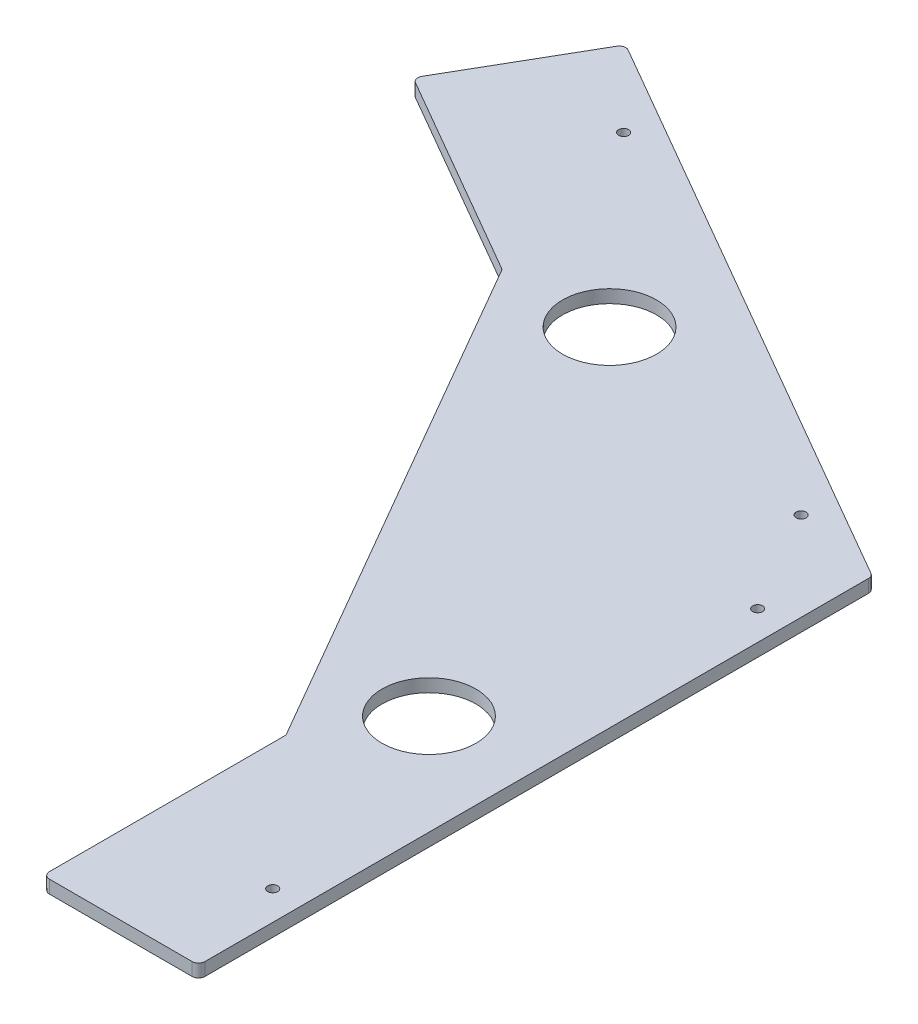
ISO-10303-21;
HEADER;
FILE_DESCRIPTION(('STEP AP214'),'2;1');
FILE_NAME('part.step','',(''),(''),'','','');
FILE_SCHEMA(('AUTOMOTIVE_DESIGN { 1 0 10303 214 1 1 1 1 }'));
ENDSEC;
DATA;
#1=APPLICATION_CONTEXT('core data for automotive mechanical design processes');
#2=APPLICATION_PROTOCOL_DEFINITION('international standard','automotive_design',2000,#1);
#3=PRODUCT_CONTEXT('',#1,'mechanical');
#4=PRODUCT('Part','Part','',(#3));
#5=PRODUCT_RELATED_PRODUCT_CATEGORY('part','',(#4));
#6=PRODUCT_DEFINITION_FORMATION('','',#4);
#7=PRODUCT_DEFINITION_CONTEXT('part definition',#1,'design');
#8=PRODUCT_DEFINITION('design','',#6,#7);
#9=PRODUCT_DEFINITION_SHAPE('','',#8);
#10=(LENGTH_UNIT() NAMED_UNIT(*) SI_UNIT(.MILLI.,.METRE.));
#11=(NAMED_UNIT(*) PLANE_ANGLE_UNIT() SI_UNIT($,.RADIAN.));
#12=(NAMED_UNIT(*) SI_UNIT($,.STERADIAN.) SOLID_ANGLE_UNIT());
#13=UNCERTAINTY_MEASURE_WITH_UNIT(LENGTH_MEASURE(1.E-05),#10,'distance_accuracy_value','');
#14=(GEOMETRIC_REPRESENTATION_CONTEXT(3) GLOBAL_UNCERTAINTY_ASSIGNED_CONTEXT((#13)) GLOBAL_UNIT_ASSIGNED_CONTEXT((#10,
#11,#12)) REPRESENTATION_CONTEXT('',''));
#15=CARTESIAN_POINT('',(0.,0.,0.));
#16=DIRECTION('',(0.,0.,1.));
#17=DIRECTION('',(1.,0.,0.));
#18=AXIS2_PLACEMENT_3D('',#15,#16,#17);
#19=CARTESIAN_POINT('',(0.,6.35,0.));
#20=DIRECTION('',(0.,1.,0.));
#21=DIRECTION('',(0.,0.,1.));
#22=AXIS2_PLACEMENT_3D('',#19,#20,#21);
#23=PLANE('',#22);
#24=CARTESIAN_POINT('',(-43.4068750823877,6.35,-338.518865913276));
#25=DIRECTION('',(0.,1.,0.));
#26=DIRECTION('',(0.,0.,1.));
#27=AXIS2_PLACEMENT_3D('',#24,#25,#26);
#28=CIRCLE('',#27,2.45744999999987);
#29=CARTESIAN_POINT('',(-43.4068750823877,6.35,-336.061415913276));
#30=VERTEX_POINT('',#29);
#31=EDGE_CURVE('E291',#30,#30,#28,.T.);
#32=ORIENTED_EDGE('',*,*,#31,.F.);
#33=EDGE_LOOP('',(#32));
#34=FACE_BOUND('',#33,.T.);
#35=CARTESIAN_POINT('',(-49.2124999999999,6.35,-162.061031219973));
#36=DIRECTION('',(0.,1.,0.));
#37=DIRECTION('',(0.,0.,1.));
#38=AXIS2_PLACEMENT_3D('',#35,#36,#37);
#39=CIRCLE('',#38,23.0187499999997);
#40=CARTESIAN_POINT('',(-49.2124999999999,6.35,-139.042281219974));
#41=VERTEX_POINT('',#40);
#42=EDGE_CURVE('E279',#41,#41,#39,.T.);
#43=ORIENTED_EDGE('',*,*,#42,.F.);
#44=EDGE_LOOP('',(#43));
#45=FACE_BOUND('',#44,.T.);
#46=CARTESIAN_POINT('',(-14.2874999999997,6.35,-50.6078687859258));
#47=DIRECTION('',(0.,1.,0.));
#48=DIRECTION('',(0.,0.,1.));
#49=AXIS2_PLACEMENT_3D('',#46,#47,#48);
#50=CIRCLE('',#49,2.45744999999931);
#51=CARTESIAN_POINT('',(-14.2874999999997,6.35,-48.1504187859265));
#52=VERTEX_POINT('',#51);
#53=EDGE_CURVE('E250',#52,#52,#50,.T.);
#54=ORIENTED_EDGE('',*,*,#53,.F.);
#55=EDGE_LOOP('',(#54));
#56=FACE_BOUND('',#55,.T.);
#57=DIRECTION('',(-0.499999999999996,0.,0.866025403784441));
#58=VECTOR('',#57,1.);
#59=CARTESIAN_POINT('',(-285.750000000001,6.35,-494.933518262806));
#60=LINE('',#59,#58);
#61=CARTESIAN_POINT('',(-287.337500000001,6.35,-492.183887605791));
#62=VERTEX_POINT('',#61);
#63=CARTESIAN_POINT('',(-322.2625,6.35,-431.692013151448));
#64=VERTEX_POINT('',#63);
#65=EDGE_CURVE('E242',#62,#64,#60,.T.);
#66=ORIENTED_EDGE('',*,*,#65,.T.);
#67=CARTESIAN_POINT('',(-319.512869342985,6.35,-430.104513151448));
#68=DIRECTION('',(0.,1.,0.));
#69=DIRECTION('',(0.,0.,1.));
#70=AXIS2_PLACEMENT_3D('',#67,#68,#69);
#71=CIRCLE('',#70,3.175);
#72=CARTESIAN_POINT('',(-321.100369342985,6.35,-427.354882494432));
#73=VERTEX_POINT('',#72);
#74=EDGE_CURVE('E205',#64,#73,#71,.T.);
#75=ORIENTED_EDGE('',*,*,#74,.T.);
#76=DIRECTION('',(0.86602540378444,0.,0.499999999999998));
#77=VECTOR('',#76,1.);
#78=CARTESIAN_POINT('',(-323.85,6.35,-428.942382494432));
#79=LINE('',#78,#77);
#80=CARTESIAN_POINT('',(-221.496872271715,6.35,-369.848776648106));
#81=VERTEX_POINT('',#80);
#82=EDGE_CURVE('E237',#73,#81,#79,.T.);
#83=ORIENTED_EDGE('',*,*,#82,.T.);
#84=CARTESIAN_POINT('',(-223.084372271715,6.35,-367.099145991091));
#85=DIRECTION('',(0.,1.,0.));
#86=DIRECTION('',(0.,0.,1.));
#87=AXIS2_PLACEMENT_3D('',#84,#85,#86);
#88=CIRCLE('',#87,3.175);
#89=CARTESIAN_POINT('',(-220.334741614699,6.35,-368.686645991091));
#90=VERTEX_POINT('',#89);
#91=EDGE_CURVE('E11',#81,#90,#88,.F.);
#92=ORIENTED_EDGE('',*,*,#91,.T.);
#93=DIRECTION('',(0.500000000000001,0.,0.866025403784438));
#94=VECTOR('',#93,1.);
#95=CARTESIAN_POINT('',(-220.760110957684,6.35,-369.423407305122));
#96=LINE('',#95,#94);
#97=CARTESIAN_POINT('',(-76.6253693429844,6.35,-119.774711692651));
#98=VERTEX_POINT('',#97);
#99=EDGE_CURVE('E236',#90,#98,#96,.T.);
#100=ORIENTED_EDGE('',*,*,#99,.T.);
#101=CARTESIAN_POINT('',(-79.375,6.35,-118.187211692651));
#102=DIRECTION('',(0.,1.,0.));
#103=DIRECTION('',(0.,0.,1.));
#104=AXIS2_PLACEMENT_3D('',#101,#102,#103);
#105=CIRCLE('',#104,3.175);
#106=CARTESIAN_POINT('',(-76.2,6.35,-118.187211692651));
#107=VERTEX_POINT('',#106);
#108=EDGE_CURVE('E146',#98,#107,#105,.F.);
#109=ORIENTED_EDGE('',*,*,#108,.T.);
#110=DIRECTION('',(0.,0.,1.));
#111=VECTOR('',#110,1.);
#112=CARTESIAN_POINT('',(-76.2,6.35,-119.03795037862));
#113=LINE('',#112,#111);
#114=CARTESIAN_POINT('',(-76.2,6.35,-3.175));
#115=VERTEX_POINT('',#114);
#116=EDGE_CURVE('E156',#107,#115,#113,.T.);
#117=ORIENTED_EDGE('',*,*,#116,.T.);
#118=CARTESIAN_POINT('',(-73.025,6.35,-3.175));
#119=DIRECTION('',(0.,1.,0.));
#120=DIRECTION('',(0.,0.,1.));
#121=AXIS2_PLACEMENT_3D('',#118,#119,#120);
#122=CIRCLE('',#121,3.175);
#123=CARTESIAN_POINT('',(-73.025,6.35,0.));
#124=VERTEX_POINT('',#123);
#125=EDGE_CURVE('E198',#115,#124,#122,.T.);
#126=ORIENTED_EDGE('',*,*,#125,.T.);
#127=DIRECTION('',(1.,0.,0.));
#128=VECTOR('',#127,1.);
#129=CARTESIAN_POINT('',(-76.2,6.35,0.));
#130=LINE('',#129,#128);
#131=CARTESIAN_POINT('',(-3.17500000000003,6.35,0.));
#132=VERTEX_POINT('',#131);
#133=EDGE_CURVE('E165',#124,#132,#130,.T.);
#134=ORIENTED_EDGE('',*,*,#133,.T.);
#135=CARTESIAN_POINT('',(-3.175,6.35,-3.175));
#136=DIRECTION('',(0.,1.,0.));
#137=DIRECTION('',(0.,0.,1.));
#138=AXIS2_PLACEMENT_3D('',#135,#136,#137);
#139=CIRCLE('',#138,3.175);
#140=CARTESIAN_POINT('',(0.,6.35,-3.175));
#141=VERTEX_POINT('',#140);
#142=EDGE_CURVE('E200',#132,#141,#139,.T.);
#143=ORIENTED_EDGE('',*,*,#142,.T.);
#144=DIRECTION('',(0.,0.,-1.));
#145=VECTOR('',#144,1.);
#146=CARTESIAN_POINT('',(0.,6.35,0.));
#147=LINE('',#146,#145);
#148=CARTESIAN_POINT('',(0.,6.35,-328.122591737194));
#149=VERTEX_POINT('',#148);
#150=EDGE_CURVE('E169',#141,#149,#147,.T.);
#151=ORIENTED_EDGE('',*,*,#150,.T.);
#152=CARTESIAN_POINT('',(-3.175,6.35,-328.122591737194));
#153=DIRECTION('',(0.,1.,0.));
#154=DIRECTION('',(0.,0.,1.));
#155=AXIS2_PLACEMENT_3D('',#152,#153,#154);
#156=CIRCLE('',#155,3.175);
#157=CARTESIAN_POINT('',(-1.58750000000003,6.35,-330.87222239421));
#158=VERTEX_POINT('',#157);
#159=EDGE_CURVE('E56',#149,#158,#156,.T.);
#160=ORIENTED_EDGE('',*,*,#159,.T.);
#161=DIRECTION('',(-0.86602540378444,0.,-0.499999999999998));
#162=VECTOR('',#161,1.);
#163=CARTESIAN_POINT('',(0.,6.35,-329.955678841871));
#164=LINE('',#163,#162);
#165=CARTESIAN_POINT('',(-283.000369342985,6.35,-493.346018262806));
#166=VERTEX_POINT('',#165);
#167=EDGE_CURVE('E266',#158,#166,#164,.T.);
#168=ORIENTED_EDGE('',*,*,#167,.T.);
#169=CARTESIAN_POINT('',(-284.587869342985,6.35,-490.596387605791));
#170=DIRECTION('',(0.,1.,0.));
#171=DIRECTION('',(0.,0.,1.));
#172=AXIS2_PLACEMENT_3D('',#169,#170,#171);
#173=CIRCLE('',#172,3.175);
#174=EDGE_CURVE('E203',#166,#62,#173,.T.);
#175=ORIENTED_EDGE('',*,*,#174,.T.);
#176=EDGE_LOOP('',(#66,#75,#83,#92,#100,#109,#117,#126,#134,#143,#151,#160,#168,#175));
#177=FACE_BOUND('',#176,.T.);
#178=CARTESIAN_POINT('',(-14.2875,6.35,-288.082628785925));
#179=DIRECTION('',(0.,1.,0.));
#180=DIRECTION('',(0.,0.,1.));
#181=AXIS2_PLACEMENT_3D('',#178,#179,#180);
#182=CIRCLE('',#181,2.45744999999968);
#183=CARTESIAN_POINT('',(-14.2875,6.35,-285.625178785926));
#184=VERTEX_POINT('',#183);
#185=EDGE_CURVE('E273',#184,#184,#182,.T.);
#186=ORIENTED_EDGE('',*,*,#185,.F.);
#187=EDGE_LOOP('',(#186));
#188=FACE_BOUND('',#187,.T.);
#189=CARTESIAN_POINT('',(-170.00728,6.35,-371.283727469078));
#190=DIRECTION('',(0.,1.,0.));
#191=DIRECTION('',(0.,0.,1.));
#192=AXIS2_PLACEMENT_3D('',#189,#190,#191);
#193=CIRCLE('',#192,23.01875);
#194=CARTESIAN_POINT('',(-170.00728,6.35,-348.264977469078));
#195=VERTEX_POINT('',#194);
#196=EDGE_CURVE('E285',#195,#195,#193,.T.);
#197=ORIENTED_EDGE('',*,*,#196,.F.);
#198=EDGE_LOOP('',(#197));
#199=FACE_BOUND('',#198,.T.);
#200=CARTESIAN_POINT('',(-249.066050000001,6.35,-457.256245913275));
#201=DIRECTION('',(0.,1.,0.));
#202=DIRECTION('',(0.,0.,1.));
#203=AXIS2_PLACEMENT_3D('',#200,#201,#202);
#204=CIRCLE('',#203,2.45745000000076);
#205=CARTESIAN_POINT('',(-249.066050000001,6.35,-454.798795913274));
#206=VERTEX_POINT('',#205);
#207=EDGE_CURVE('E297',#206,#206,#204,.T.);
#208=ORIENTED_EDGE('',*,*,#207,.F.);
#209=EDGE_LOOP('',(#208));
#210=FACE_BOUND('',#209,.T.);
#211=ADVANCED_FACE('F34',(#34,#45,#56,#177,#188,#199,#210),#23,.T.);
#212=CARTESIAN_POINT('',(0.,0.,0.));
#213=DIRECTION('',(0.,1.,0.));
#214=DIRECTION('',(0.,0.,1.));
#215=AXIS2_PLACEMENT_3D('',#212,#213,#214);
#216=PLANE('',#215);
#217=DIRECTION('',(0.86602540378444,0.,0.499999999999998));
#218=VECTOR('',#217,1.);
#219=CARTESIAN_POINT('',(-323.85,0.,-428.942382494432));
#220=LINE('',#219,#218);
#221=CARTESIAN_POINT('',(-321.100369342985,0.,-427.354882494432));
#222=VERTEX_POINT('',#221);
#223=CARTESIAN_POINT('',(-221.496872271715,0.,-369.848776648106));
#224=VERTEX_POINT('',#223);
#225=EDGE_CURVE('E171',#222,#224,#220,.T.);
#226=ORIENTED_EDGE('',*,*,#225,.F.);
#227=CARTESIAN_POINT('',(-319.512869342985,0.,-430.104513151448));
#228=DIRECTION('',(0.,1.,0.));
#229=DIRECTION('',(0.,0.,1.));
#230=AXIS2_PLACEMENT_3D('',#227,#228,#229);
#231=CIRCLE('',#230,3.175);
#232=CARTESIAN_POINT('',(-322.2625,0.,-431.692013151448));
#233=VERTEX_POINT('',#232);
#234=EDGE_CURVE('E191',#222,#233,#231,.F.);
#235=ORIENTED_EDGE('',*,*,#234,.T.);
#236=DIRECTION('',(-0.499999999999996,0.,0.866025403784441));
#237=VECTOR('',#236,1.);
#238=CARTESIAN_POINT('',(-285.750000000001,0.,-494.933518262806));
#239=LINE('',#238,#237);
#240=CARTESIAN_POINT('',(-287.337500000001,0.,-492.183887605791));
#241=VERTEX_POINT('',#240);
#242=EDGE_CURVE('E229',#241,#233,#239,.T.);
#243=ORIENTED_EDGE('',*,*,#242,.F.);
#244=CARTESIAN_POINT('',(-284.587869342985,0.,-490.596387605791));
#245=DIRECTION('',(0.,1.,0.));
#246=DIRECTION('',(0.,0.,1.));
#247=AXIS2_PLACEMENT_3D('',#244,#245,#246);
#248=CIRCLE('',#247,3.175);
#249=CARTESIAN_POINT('',(-283.000369342985,0.,-493.346018262806));
#250=VERTEX_POINT('',#249);
#251=EDGE_CURVE('E189',#241,#250,#248,.F.);
#252=ORIENTED_EDGE('',*,*,#251,.T.);
#253=DIRECTION('',(-0.86602540378444,0.,-0.499999999999998));
#254=VECTOR('',#253,1.);
#255=CARTESIAN_POINT('',(0.,0.,-329.955678841871));
#256=LINE('',#255,#254);
#257=CARTESIAN_POINT('',(-1.58750000000003,0.,-330.87222239421));
#258=VERTEX_POINT('',#257);
#259=EDGE_CURVE('E253',#258,#250,#256,.T.);
#260=ORIENTED_EDGE('',*,*,#259,.F.);
#261=CARTESIAN_POINT('',(-3.175,0.,-328.122591737194));
#262=DIRECTION('',(0.,1.,0.));
#263=DIRECTION('',(0.,0.,1.));
#264=AXIS2_PLACEMENT_3D('',#261,#262,#263);
#265=CIRCLE('',#264,3.175);
#266=CARTESIAN_POINT('',(0.,0.,-328.122591737194));
#267=VERTEX_POINT('',#266);
#268=EDGE_CURVE('E187',#258,#267,#265,.F.);
#269=ORIENTED_EDGE('',*,*,#268,.T.);
#270=DIRECTION('',(0.,0.,-1.));
#271=VECTOR('',#270,1.);
#272=CARTESIAN_POINT('',(0.,0.,0.));
#273=LINE('',#272,#271);
#274=CARTESIAN_POINT('',(0.,0.,-3.175));
#275=VERTEX_POINT('',#274);
#276=EDGE_CURVE('E249',#275,#267,#273,.T.);
#277=ORIENTED_EDGE('',*,*,#276,.F.);
#278=CARTESIAN_POINT('',(-3.175,0.,-3.175));
#279=DIRECTION('',(0.,1.,0.));
#280=DIRECTION('',(0.,0.,1.));
#281=AXIS2_PLACEMENT_3D('',#278,#279,#280);
#282=CIRCLE('',#281,3.175);
#283=CARTESIAN_POINT('',(-3.17500000000003,0.,0.));
#284=VERTEX_POINT('',#283);
#285=EDGE_CURVE('E185',#275,#284,#282,.F.);
#286=ORIENTED_EDGE('',*,*,#285,.T.);
#287=DIRECTION('',(1.,0.,0.));
#288=VECTOR('',#287,1.);
#289=CARTESIAN_POINT('',(-76.2,0.,0.));
#290=LINE('',#289,#288);
#291=CARTESIAN_POINT('',(-73.025,0.,0.));
#292=VERTEX_POINT('',#291);
#293=EDGE_CURVE('E246',#292,#284,#290,.T.);
#294=ORIENTED_EDGE('',*,*,#293,.F.);
#295=CARTESIAN_POINT('',(-73.025,0.,-3.175));
#296=DIRECTION('',(0.,1.,0.));
#297=DIRECTION('',(0.,0.,1.));
#298=AXIS2_PLACEMENT_3D('',#295,#296,#297);
#299=CIRCLE('',#298,3.175);
#300=CARTESIAN_POINT('',(-76.2,0.,-3.175));
#301=VERTEX_POINT('',#300);
#302=EDGE_CURVE('E164',#292,#301,#299,.F.);
#303=ORIENTED_EDGE('',*,*,#302,.T.);
#304=DIRECTION('',(0.,0.,1.));
#305=VECTOR('',#304,1.);
#306=CARTESIAN_POINT('',(-76.2,0.,-119.03795037862));
#307=LINE('',#306,#305);
#308=CARTESIAN_POINT('',(-76.2,0.,-118.187211692651));
#309=VERTEX_POINT('',#308);
#310=EDGE_CURVE('E153',#309,#301,#307,.T.);
#311=ORIENTED_EDGE('',*,*,#310,.F.);
#312=CARTESIAN_POINT('',(-79.375,0.,-118.187211692651));
#313=DIRECTION('',(0.,1.,0.));
#314=DIRECTION('',(0.,0.,1.));
#315=AXIS2_PLACEMENT_3D('',#312,#313,#314);
#316=CIRCLE('',#315,3.175);
#317=CARTESIAN_POINT('',(-76.6253693429844,0.,-119.774711692651));
#318=VERTEX_POINT('',#317);
#319=EDGE_CURVE('E136',#309,#318,#316,.T.);
#320=ORIENTED_EDGE('',*,*,#319,.T.);
#321=DIRECTION('',(0.500000000000001,0.,0.866025403784438));
#322=VECTOR('',#321,1.);
#323=CARTESIAN_POINT('',(-220.760110957684,0.,-369.423407305122));
#324=LINE('',#323,#322);
#325=CARTESIAN_POINT('',(-220.334741614699,0.,-368.686645991091));
#326=VERTEX_POINT('',#325);
#327=EDGE_CURVE('E166',#326,#318,#324,.T.);
#328=ORIENTED_EDGE('',*,*,#327,.F.);
#329=CARTESIAN_POINT('',(-223.084372271715,0.,-367.099145991091));
#330=DIRECTION('',(0.,1.,0.));
#331=DIRECTION('',(0.,0.,1.));
#332=AXIS2_PLACEMENT_3D('',#329,#330,#331);
#333=CIRCLE('',#332,3.175);
#334=EDGE_CURVE('E42',#326,#224,#333,.T.);
#335=ORIENTED_EDGE('',*,*,#334,.T.);
#336=EDGE_LOOP('',(#226,#235,#243,#252,#260,#269,#277,#286,#294,#303,#311,#320,#328,#335));
#337=FACE_BOUND('',#336,.T.);
#338=CARTESIAN_POINT('',(-14.2874999999997,0.,-50.6078687859258));
#339=DIRECTION('',(0.,1.,0.));
#340=DIRECTION('',(0.,0.,1.));
#341=AXIS2_PLACEMENT_3D('',#338,#339,#340);
#342=CIRCLE('',#341,2.45744999999931);
#343=CARTESIAN_POINT('',(-14.2874999999997,0.,-48.1504187859265));
#344=VERTEX_POINT('',#343);
#345=EDGE_CURVE('E270',#344,#344,#342,.T.);
#346=ORIENTED_EDGE('',*,*,#345,.T.);
#347=EDGE_LOOP('',(#346));
#348=FACE_BOUND('',#347,.T.);
#349=CARTESIAN_POINT('',(-14.2875,0.,-288.082628785925));
#350=DIRECTION('',(0.,1.,0.));
#351=DIRECTION('',(0.,0.,1.));
#352=AXIS2_PLACEMENT_3D('',#349,#350,#351);
#353=CIRCLE('',#352,2.45744999999968);
#354=CARTESIAN_POINT('',(-14.2875,0.,-285.625178785926));
#355=VERTEX_POINT('',#354);
#356=EDGE_CURVE('E276',#355,#355,#353,.T.);
#357=ORIENTED_EDGE('',*,*,#356,.T.);
#358=EDGE_LOOP('',(#357));
#359=FACE_BOUND('',#358,.T.);
#360=CARTESIAN_POINT('',(-49.2124999999999,0.,-162.061031219973));
#361=DIRECTION('',(0.,1.,0.));
#362=DIRECTION('',(0.,0.,1.));
#363=AXIS2_PLACEMENT_3D('',#360,#361,#362);
#364=CIRCLE('',#363,23.0187499999997);
#365=CARTESIAN_POINT('',(-49.2124999999999,0.,-139.042281219974));
#366=VERTEX_POINT('',#365);
#367=EDGE_CURVE('E282',#366,#366,#364,.T.);
#368=ORIENTED_EDGE('',*,*,#367,.T.);
#369=EDGE_LOOP('',(#368));
#370=FACE_BOUND('',#369,.T.);
#371=CARTESIAN_POINT('',(-170.00728,0.,-371.283727469078));
#372=DIRECTION('',(0.,1.,0.));
#373=DIRECTION('',(0.,0.,1.));
#374=AXIS2_PLACEMENT_3D('',#371,#372,#373);
#375=CIRCLE('',#374,23.01875);
#376=CARTESIAN_POINT('',(-170.00728,0.,-348.264977469078));
#377=VERTEX_POINT('',#376);
#378=EDGE_CURVE('E288',#377,#377,#375,.T.);
#379=ORIENTED_EDGE('',*,*,#378,.T.);
#380=EDGE_LOOP('',(#379));
#381=FACE_BOUND('',#380,.T.);
#382=CARTESIAN_POINT('',(-43.4068750823877,0.,-338.518865913276));
#383=DIRECTION('',(0.,1.,0.));
#384=DIRECTION('',(0.,0.,1.));
#385=AXIS2_PLACEMENT_3D('',#382,#383,#384);
#386=CIRCLE('',#385,2.45744999999987);
#387=CARTESIAN_POINT('',(-43.4068750823877,0.,-336.061415913276));
#388=VERTEX_POINT('',#387);
#389=EDGE_CURVE('E294',#388,#388,#386,.T.);
#390=ORIENTED_EDGE('',*,*,#389,.T.);
#391=EDGE_LOOP('',(#390));
#392=FACE_BOUND('',#391,.T.);
#393=CARTESIAN_POINT('',(-249.066050000001,0.,-457.256245913275));
#394=DIRECTION('',(0.,1.,0.));
#395=DIRECTION('',(0.,0.,1.));
#396=AXIS2_PLACEMENT_3D('',#393,#394,#395);
#397=CIRCLE('',#396,2.45745000000076);
#398=CARTESIAN_POINT('',(-249.066050000001,0.,-454.798795913274));
#399=VERTEX_POINT('',#398);
#400=EDGE_CURVE('E300',#399,#399,#397,.T.);
#401=ORIENTED_EDGE('',*,*,#400,.T.);
#402=EDGE_LOOP('',(#401));
#403=FACE_BOUND('',#402,.T.);
#404=ADVANCED_FACE('F161',(#337,#348,#359,#370,#381,#392,#403),#216,.F.);
#405=CARTESIAN_POINT('',(-76.2,6.35,0.));
#406=DIRECTION('',(0.,0.,-1.));
#407=DIRECTION('',(-1.,0.,0.));
#408=AXIS2_PLACEMENT_3D('',#405,#406,#407);
#409=PLANE('',#408);
#410=ORIENTED_EDGE('',*,*,#293,.T.);
#411=DIRECTION('',(0.,-1.,0.));
#412=VECTOR('',#411,1.);
#413=CARTESIAN_POINT('',(-3.175,6.35,0.));
#414=LINE('',#413,#412);
#415=EDGE_CURVE('E147',#284,#132,#414,.F.);
#416=ORIENTED_EDGE('',*,*,#415,.T.);
#417=ORIENTED_EDGE('',*,*,#133,.F.);
#418=DIRECTION('',(0.,-1.,0.));
#419=VECTOR('',#418,1.);
#420=CARTESIAN_POINT('',(-73.025,6.35,0.));
#421=LINE('',#420,#419);
#422=EDGE_CURVE('E216',#124,#292,#421,.T.);
#423=ORIENTED_EDGE('',*,*,#422,.T.);
#424=EDGE_LOOP('',(#410,#416,#417,#423));
#425=FACE_BOUND('',#424,.T.);
#426=ADVANCED_FACE('F315',(#425),#409,.F.);
#427=CARTESIAN_POINT('',(0.,6.35,0.));
#428=DIRECTION('',(-1.,0.,0.));
#429=DIRECTION('',(0.,0.,1.));
#430=AXIS2_PLACEMENT_3D('',#427,#428,#429);
#431=PLANE('',#430);
#432=ORIENTED_EDGE('',*,*,#276,.T.);
#433=DIRECTION('',(0.,-1.,0.));
#434=VECTOR('',#433,1.);
#435=CARTESIAN_POINT('',(0.,6.35,-328.122591737194));
#436=LINE('',#435,#434);
#437=EDGE_CURVE('E214',#267,#149,#436,.F.);
#438=ORIENTED_EDGE('',*,*,#437,.T.);
#439=ORIENTED_EDGE('',*,*,#150,.F.);
#440=DIRECTION('',(0.,-1.,0.));
#441=VECTOR('',#440,1.);
#442=CARTESIAN_POINT('',(0.,6.35,-3.175));
#443=LINE('',#442,#441);
#444=EDGE_CURVE('E211',#141,#275,#443,.T.);
#445=ORIENTED_EDGE('',*,*,#444,.T.);
#446=EDGE_LOOP('',(#432,#438,#439,#445));
#447=FACE_BOUND('',#446,.T.);
#448=ADVANCED_FACE('F334',(#447),#431,.F.);
#449=CARTESIAN_POINT('',(0.,6.35,-329.955678841871));
#450=DIRECTION('',(-0.499999999999998,0.,0.86602540378444));
#451=DIRECTION('',(0.86602540378444,0.,0.499999999999998));
#452=AXIS2_PLACEMENT_3D('',#449,#450,#451);
#453=PLANE('',#452);
#454=ORIENTED_EDGE('',*,*,#259,.T.);
#455=DIRECTION('',(0.,-1.,0.));
#456=VECTOR('',#455,1.);
#457=CARTESIAN_POINT('',(-283.000369342985,6.35,-493.346018262806));
#458=LINE('',#457,#456);
#459=EDGE_CURVE('E49',#250,#166,#458,.F.);
#460=ORIENTED_EDGE('',*,*,#459,.T.);
#461=ORIENTED_EDGE('',*,*,#167,.F.);
#462=DIRECTION('',(0.,-1.,0.));
#463=VECTOR('',#462,1.);
#464=CARTESIAN_POINT('',(-1.58750000000002,6.35,-330.87222239421));
#465=LINE('',#464,#463);
#466=EDGE_CURVE('E207',#158,#258,#465,.T.);
#467=ORIENTED_EDGE('',*,*,#466,.T.);
#468=EDGE_LOOP('',(#454,#460,#461,#467));
#469=FACE_BOUND('',#468,.T.);
#470=ADVANCED_FACE('F331',(#469),#453,.F.);
#471=CARTESIAN_POINT('',(-285.750000000001,6.35,-494.933518262806));
#472=DIRECTION('',(0.866025403784441,0.,0.499999999999996));
#473=DIRECTION('',(0.499999999999996,0.,-0.866025403784441));
#474=AXIS2_PLACEMENT_3D('',#471,#472,#473);
#475=PLANE('',#474);
#476=ORIENTED_EDGE('',*,*,#242,.T.);
#477=DIRECTION('',(0.,-1.,0.));
#478=VECTOR('',#477,1.);
#479=CARTESIAN_POINT('',(-322.2625,6.35,-431.692013151448));
#480=LINE('',#479,#478);
#481=EDGE_CURVE('E196',#233,#64,#480,.F.);
#482=ORIENTED_EDGE('',*,*,#481,.T.);
#483=ORIENTED_EDGE('',*,*,#65,.F.);
#484=DIRECTION('',(0.,-1.,0.));
#485=VECTOR('',#484,1.);
#486=CARTESIAN_POINT('',(-287.337500000001,6.35,-492.183887605791));
#487=LINE('',#486,#485);
#488=EDGE_CURVE('E193',#62,#241,#487,.T.);
#489=ORIENTED_EDGE('',*,*,#488,.T.);
#490=EDGE_LOOP('',(#476,#482,#483,#489));
#491=FACE_BOUND('',#490,.T.);
#492=ADVANCED_FACE('F259',(#491),#475,.F.);
#493=CARTESIAN_POINT('',(-323.85,6.35,-428.942382494432));
#494=DIRECTION('',(0.499999999999998,0.,-0.86602540378444));
#495=DIRECTION('',(-0.86602540378444,0.,-0.499999999999998));
#496=AXIS2_PLACEMENT_3D('',#493,#494,#495);
#497=PLANE('',#496);
#498=ORIENTED_EDGE('',*,*,#225,.T.);
#499=DIRECTION('',(0.,-1.,0.));
#500=VECTOR('',#499,1.);
#501=CARTESIAN_POINT('',(-221.496872271715,6.35,-369.848776648106));
#502=LINE('',#501,#500);
#503=EDGE_CURVE('E182',#224,#81,#502,.F.);
#504=ORIENTED_EDGE('',*,*,#503,.T.);
#505=ORIENTED_EDGE('',*,*,#82,.F.);
#506=DIRECTION('',(0.,-1.,0.));
#507=VECTOR('',#506,1.);
#508=CARTESIAN_POINT('',(-321.100369342985,6.35,-427.354882494432));
#509=LINE('',#508,#507);
#510=EDGE_CURVE('E179',#73,#222,#509,.T.);
#511=ORIENTED_EDGE('',*,*,#510,.T.);
#512=EDGE_LOOP('',(#498,#504,#505,#511));
#513=FACE_BOUND('',#512,.T.);
#514=ADVANCED_FACE('F225',(#513),#497,.F.);
#515=CARTESIAN_POINT('',(-220.760110957684,6.35,-369.423407305122));
#516=DIRECTION('',(0.866025403784438,0.,-0.500000000000001));
#517=DIRECTION('',(-0.500000000000001,0.,-0.866025403784438));
#518=AXIS2_PLACEMENT_3D('',#515,#516,#517);
#519=PLANE('',#518);
#520=ORIENTED_EDGE('',*,*,#327,.T.);
#521=DIRECTION('',(0.,-1.,0.));
#522=VECTOR('',#521,1.);
#523=CARTESIAN_POINT('',(-76.6253693429844,6.35,-119.774711692651));
#524=LINE('',#523,#522);
#525=EDGE_CURVE('E141',#318,#98,#524,.F.);
#526=ORIENTED_EDGE('',*,*,#525,.T.);
#527=ORIENTED_EDGE('',*,*,#99,.F.);
#528=DIRECTION('',(0.,-1.,0.));
#529=VECTOR('',#528,1.);
#530=CARTESIAN_POINT('',(-220.334741614699,0.,-368.686645991091));
#531=LINE('',#530,#529);
#532=EDGE_CURVE('E157',#90,#326,#531,.T.);
#533=ORIENTED_EDGE('',*,*,#532,.T.);
#534=EDGE_LOOP('',(#520,#526,#527,#533));
#535=FACE_BOUND('',#534,.T.);
#536=ADVANCED_FACE('F239',(#535),#519,.F.);
#537=CARTESIAN_POINT('',(-76.2,6.35,-119.03795037862));
#538=DIRECTION('',(1.,0.,0.));
#539=DIRECTION('',(0.,0.,-1.));
#540=AXIS2_PLACEMENT_3D('',#537,#538,#539);
#541=PLANE('',#540);
#542=ORIENTED_EDGE('',*,*,#116,.F.);
#543=DIRECTION('',(0.,-1.,0.));
#544=VECTOR('',#543,1.);
#545=CARTESIAN_POINT('',(-76.2,0.,-118.187211692651));
#546=LINE('',#545,#544);
#547=EDGE_CURVE('E140',#107,#309,#546,.T.);
#548=ORIENTED_EDGE('',*,*,#547,.T.);
#549=ORIENTED_EDGE('',*,*,#310,.T.);
#550=DIRECTION('',(0.,-1.,0.));
#551=VECTOR('',#550,1.);
#552=CARTESIAN_POINT('',(-76.2,6.35,-3.175));
#553=LINE('',#552,#551);
#554=EDGE_CURVE('E158',#301,#115,#553,.F.);
#555=ORIENTED_EDGE('',*,*,#554,.T.);
#556=EDGE_LOOP('',(#542,#548,#549,#555));
#557=FACE_BOUND('',#556,.T.);
#558=ADVANCED_FACE('F152',(#557),#541,.F.);
#559=CARTESIAN_POINT('',(-14.2874999999997,6.35,-50.6078687859258));
#560=DIRECTION('',(0.,-1.,0.));
#561=DIRECTION('',(0.,0.,-1.));
#562=AXIS2_PLACEMENT_3D('',#559,#560,#561);
#563=CYLINDRICAL_SURFACE('',#562,2.45744999999931);
#564=ORIENTED_EDGE('',*,*,#53,.T.);
#565=EDGE_LOOP('',(#564));
#566=FACE_BOUND('',#565,.T.);
#567=ORIENTED_EDGE('',*,*,#345,.F.);
#568=EDGE_LOOP('',(#567));
#569=FACE_BOUND('',#568,.T.);
#570=ADVANCED_FACE('F320',(#566,#569),#563,.F.);
#571=CARTESIAN_POINT('',(-14.2875,6.35,-288.082628785925));
#572=DIRECTION('',(0.,-1.,0.));
#573=DIRECTION('',(0.,0.,-1.));
#574=AXIS2_PLACEMENT_3D('',#571,#572,#573);
#575=CYLINDRICAL_SURFACE('',#574,2.45744999999968);
#576=ORIENTED_EDGE('',*,*,#185,.T.);
#577=EDGE_LOOP('',(#576));
#578=FACE_BOUND('',#577,.T.);
#579=ORIENTED_EDGE('',*,*,#356,.F.);
#580=EDGE_LOOP('',(#579));
#581=FACE_BOUND('',#580,.T.);
#582=ADVANCED_FACE('F500',(#578,#581),#575,.F.);
#583=CARTESIAN_POINT('',(-49.2124999999999,6.35,-162.061031219973));
#584=DIRECTION('',(0.,-1.,0.));
#585=DIRECTION('',(0.,0.,-1.));
#586=AXIS2_PLACEMENT_3D('',#583,#584,#585);
#587=CYLINDRICAL_SURFACE('',#586,23.0187499999997);
#588=ORIENTED_EDGE('',*,*,#42,.T.);
#589=EDGE_LOOP('',(#588));
#590=FACE_BOUND('',#589,.T.);
#591=ORIENTED_EDGE('',*,*,#367,.F.);
#592=EDGE_LOOP('',(#591));
#593=FACE_BOUND('',#592,.T.);
#594=ADVANCED_FACE('F490',(#590,#593),#587,.F.);
#595=CARTESIAN_POINT('',(-170.00728,6.35,-371.283727469078));
#596=DIRECTION('',(0.,-1.,0.));
#597=DIRECTION('',(0.,0.,-1.));
#598=AXIS2_PLACEMENT_3D('',#595,#596,#597);
#599=CYLINDRICAL_SURFACE('',#598,23.01875);
#600=ORIENTED_EDGE('',*,*,#196,.T.);
#601=EDGE_LOOP('',(#600));
#602=FACE_BOUND('',#601,.T.);
#603=ORIENTED_EDGE('',*,*,#378,.F.);
#604=EDGE_LOOP('',(#603));
#605=FACE_BOUND('',#604,.T.);
#606=ADVANCED_FACE('F480',(#602,#605),#599,.F.);
#607=CARTESIAN_POINT('',(-43.4068750823877,6.35,-338.518865913276));
#608=DIRECTION('',(0.,-1.,0.));
#609=DIRECTION('',(0.,0.,-1.));
#610=AXIS2_PLACEMENT_3D('',#607,#608,#609);
#611=CYLINDRICAL_SURFACE('',#610,2.45744999999987);
#612=ORIENTED_EDGE('',*,*,#31,.T.);
#613=EDGE_LOOP('',(#612));
#614=FACE_BOUND('',#613,.T.);
#615=ORIENTED_EDGE('',*,*,#389,.F.);
#616=EDGE_LOOP('',(#615));
#617=FACE_BOUND('',#616,.T.);
#618=ADVANCED_FACE('F471',(#614,#617),#611,.F.);
#619=CARTESIAN_POINT('',(-249.066050000001,6.35,-457.256245913275));
#620=DIRECTION('',(0.,-1.,0.));
#621=DIRECTION('',(0.,0.,-1.));
#622=AXIS2_PLACEMENT_3D('',#619,#620,#621);
#623=CYLINDRICAL_SURFACE('',#622,2.45745000000076);
#624=ORIENTED_EDGE('',*,*,#207,.T.);
#625=EDGE_LOOP('',(#624));
#626=FACE_BOUND('',#625,.T.);
#627=ORIENTED_EDGE('',*,*,#400,.F.);
#628=EDGE_LOOP('',(#627));
#629=FACE_BOUND('',#628,.T.);
#630=ADVANCED_FACE('F306',(#626,#629),#623,.F.);
#631=CARTESIAN_POINT('',(-79.375,6.35,-118.187211692651));
#632=DIRECTION('',(0.,1.,0.));
#633=DIRECTION('',(0.,0.,1.));
#634=AXIS2_PLACEMENT_3D('',#631,#632,#633);
#635=CYLINDRICAL_SURFACE('',#634,3.175);
#636=ORIENTED_EDGE('',*,*,#108,.F.);
#637=ORIENTED_EDGE('',*,*,#525,.F.);
#638=ORIENTED_EDGE('',*,*,#319,.F.);
#639=ORIENTED_EDGE('',*,*,#547,.F.);
#640=EDGE_LOOP('',(#636,#637,#638,#639));
#641=FACE_BOUND('',#640,.T.);
#642=ADVANCED_FACE('F139',(#641),#635,.F.);
#643=CARTESIAN_POINT('',(-223.084372271715,6.35,-367.099145991091));
#644=DIRECTION('',(0.,1.,0.));
#645=DIRECTION('',(0.,0.,1.));
#646=AXIS2_PLACEMENT_3D('',#643,#644,#645);
#647=CYLINDRICAL_SURFACE('',#646,3.175);
#648=ORIENTED_EDGE('',*,*,#91,.F.);
#649=ORIENTED_EDGE('',*,*,#503,.F.);
#650=ORIENTED_EDGE('',*,*,#334,.F.);
#651=ORIENTED_EDGE('',*,*,#532,.F.);
#652=EDGE_LOOP('',(#648,#649,#650,#651));
#653=FACE_BOUND('',#652,.T.);
#654=ADVANCED_FACE('F231',(#653),#647,.F.);
#655=CARTESIAN_POINT('',(-319.512869342985,6.35,-430.104513151448));
#656=DIRECTION('',(0.,-1.,0.));
#657=DIRECTION('',(0.,0.,-1.));
#658=AXIS2_PLACEMENT_3D('',#655,#656,#657);
#659=CYLINDRICAL_SURFACE('',#658,3.175);
#660=ORIENTED_EDGE('',*,*,#74,.F.);
#661=ORIENTED_EDGE('',*,*,#481,.F.);
#662=ORIENTED_EDGE('',*,*,#234,.F.);
#663=ORIENTED_EDGE('',*,*,#510,.F.);
#664=EDGE_LOOP('',(#660,#661,#662,#663));
#665=FACE_BOUND('',#664,.T.);
#666=ADVANCED_FACE('F264',(#665),#659,.T.);
#667=CARTESIAN_POINT('',(-284.587869342985,6.35,-490.596387605791));
#668=DIRECTION('',(0.,-1.,0.));
#669=DIRECTION('',(0.,0.,-1.));
#670=AXIS2_PLACEMENT_3D('',#667,#668,#669);
#671=CYLINDRICAL_SURFACE('',#670,3.175);
#672=ORIENTED_EDGE('',*,*,#174,.F.);
#673=ORIENTED_EDGE('',*,*,#459,.F.);
#674=ORIENTED_EDGE('',*,*,#251,.F.);
#675=ORIENTED_EDGE('',*,*,#488,.F.);
#676=EDGE_LOOP('',(#672,#673,#674,#675));
#677=FACE_BOUND('',#676,.T.);
#678=ADVANCED_FACE('F347',(#677),#671,.T.);
#679=CARTESIAN_POINT('',(-3.175,6.35,-328.122591737194));
#680=DIRECTION('',(0.,-1.,0.));
#681=DIRECTION('',(0.,0.,-1.));
#682=AXIS2_PLACEMENT_3D('',#679,#680,#681);
#683=CYLINDRICAL_SURFACE('',#682,3.175);
#684=ORIENTED_EDGE('',*,*,#159,.F.);
#685=ORIENTED_EDGE('',*,*,#437,.F.);
#686=ORIENTED_EDGE('',*,*,#268,.F.);
#687=ORIENTED_EDGE('',*,*,#466,.F.);
#688=EDGE_LOOP('',(#684,#685,#686,#687));
#689=FACE_BOUND('',#688,.T.);
#690=ADVANCED_FACE('F350',(#689),#683,.T.);
#691=CARTESIAN_POINT('',(-3.175,6.35,-3.175));
#692=DIRECTION('',(0.,-1.,0.));
#693=DIRECTION('',(0.,0.,-1.));
#694=AXIS2_PLACEMENT_3D('',#691,#692,#693);
#695=CYLINDRICAL_SURFACE('',#694,3.175);
#696=ORIENTED_EDGE('',*,*,#142,.F.);
#697=ORIENTED_EDGE('',*,*,#415,.F.);
#698=ORIENTED_EDGE('',*,*,#285,.F.);
#699=ORIENTED_EDGE('',*,*,#444,.F.);
#700=EDGE_LOOP('',(#696,#697,#698,#699));
#701=FACE_BOUND('',#700,.T.);
#702=ADVANCED_FACE('F353',(#701),#695,.T.);
#703=CARTESIAN_POINT('',(-73.025,6.35,-3.175));
#704=DIRECTION('',(0.,-1.,0.));
#705=DIRECTION('',(0.,0.,-1.));
#706=AXIS2_PLACEMENT_3D('',#703,#704,#705);
#707=CYLINDRICAL_SURFACE('',#706,3.175);
#708=ORIENTED_EDGE('',*,*,#125,.F.);
#709=ORIENTED_EDGE('',*,*,#554,.F.);
#710=ORIENTED_EDGE('',*,*,#302,.F.);
#711=ORIENTED_EDGE('',*,*,#422,.F.);
#712=EDGE_LOOP('',(#708,#709,#710,#711));
#713=FACE_BOUND('',#712,.T.);
#714=ADVANCED_FACE('F36',(#713),#707,.T.);
#715=CLOSED_SHELL('',(#211,#404,#426,#448,#470,#492,#514,#536,#558,#570,#582,#594,#606,#618,
#630,#642,#654,#666,#678,#690,#702,#714));
#716=MANIFOLD_SOLID_BREP('B2',#715);
#717=ADVANCED_BREP_SHAPE_REPRESENTATION('',(#18,#716),#14);
#718=SHAPE_DEFINITION_REPRESENTATION(#9,#717);
ENDSEC;
END-ISO-10303-21;
